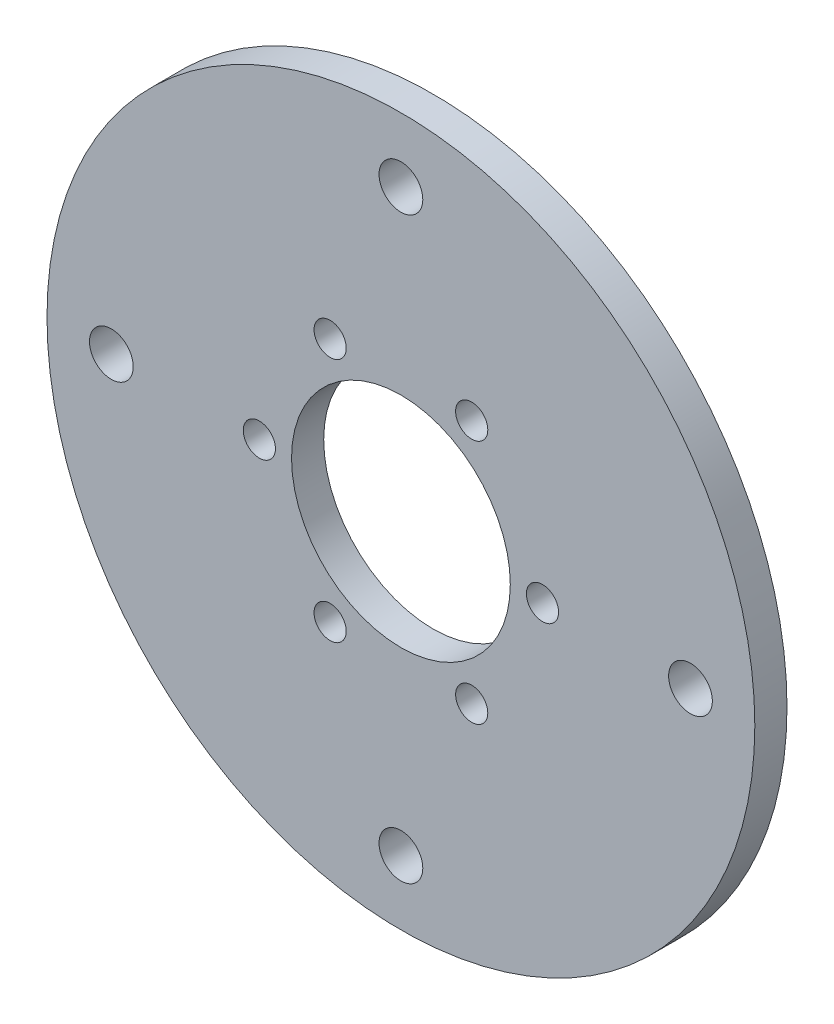
ISO-10303-21;
HEADER;
FILE_DESCRIPTION(('STEP AP214'),'2;1');
FILE_NAME('part.step','',(''),(''),'','','');
FILE_SCHEMA(('AUTOMOTIVE_DESIGN { 1 0 10303 214 1 1 1 1 }'));
ENDSEC;
DATA;
#1=APPLICATION_CONTEXT('core data for automotive mechanical design processes');
#2=APPLICATION_PROTOCOL_DEFINITION('international standard','automotive_design',2000,#1);
#3=PRODUCT_CONTEXT('',#1,'mechanical');
#4=PRODUCT('Part','Part','',(#3));
#5=PRODUCT_RELATED_PRODUCT_CATEGORY('part','',(#4));
#6=PRODUCT_DEFINITION_FORMATION('','',#4);
#7=PRODUCT_DEFINITION_CONTEXT('part definition',#1,'design');
#8=PRODUCT_DEFINITION('design','',#6,#7);
#9=PRODUCT_DEFINITION_SHAPE('','',#8);
#10=(LENGTH_UNIT() NAMED_UNIT(*) SI_UNIT(.MILLI.,.METRE.));
#11=(NAMED_UNIT(*) PLANE_ANGLE_UNIT() SI_UNIT($,.RADIAN.));
#12=(NAMED_UNIT(*) SI_UNIT($,.STERADIAN.) SOLID_ANGLE_UNIT());
#13=UNCERTAINTY_MEASURE_WITH_UNIT(LENGTH_MEASURE(1.E-05),#10,'distance_accuracy_value','');
#14=(GEOMETRIC_REPRESENTATION_CONTEXT(3) GLOBAL_UNCERTAINTY_ASSIGNED_CONTEXT((#13)) GLOBAL_UNIT_ASSIGNED_CONTEXT((#10,
#11,#12)) REPRESENTATION_CONTEXT('',''));
#15=CARTESIAN_POINT('',(0.,0.,0.));
#16=DIRECTION('',(0.,0.,1.));
#17=DIRECTION('',(1.,0.,0.));
#18=AXIS2_PLACEMENT_3D('',#15,#16,#17);
#19=CARTESIAN_POINT('',(0.,0.,5.));
#20=DIRECTION('',(0.,0.,1.));
#21=DIRECTION('',(1.,0.,0.));
#22=AXIS2_PLACEMENT_3D('',#19,#20,#21);
#23=PLANE('',#22);
#24=CARTESIAN_POINT('',(10.9999999999999,19.0525588832577,5.));
#25=DIRECTION('',(0.,0.,1.));
#26=DIRECTION('',(1.,0.,0.));
#27=AXIS2_PLACEMENT_3D('',#24,#25,#26);
#28=CIRCLE('',#27,2.5);
#29=CARTESIAN_POINT('',(13.4999999999999,19.0525588832577,5.));
#30=VERTEX_POINT('',#29);
#31=EDGE_CURVE('E105',#30,#30,#28,.T.);
#32=ORIENTED_EDGE('',*,*,#31,.F.);
#33=EDGE_LOOP('',(#32));
#34=FACE_BOUND('',#33,.T.);
#35=CARTESIAN_POINT('',(22.0000000000012,8.23535218910547E-13,5.));
#36=DIRECTION('',(0.,0.,1.));
#37=DIRECTION('',(1.,0.,0.));
#38=AXIS2_PLACEMENT_3D('',#35,#36,#37);
#39=CIRCLE('',#38,2.5);
#40=CARTESIAN_POINT('',(24.5000000000012,8.23535218910547E-13,5.));
#41=VERTEX_POINT('',#40);
#42=EDGE_CURVE('E99',#41,#41,#39,.T.);
#43=ORIENTED_EDGE('',*,*,#42,.F.);
#44=EDGE_LOOP('',(#43));
#45=FACE_BOUND('',#44,.T.);
#46=CARTESIAN_POINT('',(11.0000000000026,-19.0525588832576,5.));
#47=DIRECTION('',(0.,0.,1.));
#48=DIRECTION('',(1.,0.,0.));
#49=AXIS2_PLACEMENT_3D('',#46,#47,#48);
#50=CIRCLE('',#49,2.5);
#51=CARTESIAN_POINT('',(13.5000000000026,-19.0525588832576,5.));
#52=VERTEX_POINT('',#51);
#53=EDGE_CURVE('E93',#52,#52,#50,.T.);
#54=ORIENTED_EDGE('',*,*,#53,.F.);
#55=EDGE_LOOP('',(#54));
#56=FACE_BOUND('',#55,.T.);
#57=CARTESIAN_POINT('',(-10.9999999999975,-19.0525588832592,5.));
#58=DIRECTION('',(0.,0.,1.));
#59=DIRECTION('',(1.,0.,0.));
#60=AXIS2_PLACEMENT_3D('',#57,#58,#59);
#61=CIRCLE('',#60,2.5);
#62=CARTESIAN_POINT('',(-8.49999999999747,-19.0525588832592,5.));
#63=VERTEX_POINT('',#62);
#64=EDGE_CURVE('E87',#63,#63,#61,.T.);
#65=ORIENTED_EDGE('',*,*,#64,.F.);
#66=EDGE_LOOP('',(#65));
#67=FACE_BOUND('',#66,.T.);
#68=CARTESIAN_POINT('',(-21.9999999999988,-2.26747567222674E-12,5.));
#69=DIRECTION('',(0.,0.,1.));
#70=DIRECTION('',(1.,0.,0.));
#71=AXIS2_PLACEMENT_3D('',#68,#69,#70);
#72=CIRCLE('',#71,2.5);
#73=CARTESIAN_POINT('',(-19.4999999999988,-2.26747567222674E-12,5.));
#74=VERTEX_POINT('',#73);
#75=EDGE_CURVE('E81',#74,#74,#72,.T.);
#76=ORIENTED_EDGE('',*,*,#75,.F.);
#77=EDGE_LOOP('',(#76));
#78=FACE_BOUND('',#77,.T.);
#79=CARTESIAN_POINT('',(-11.0000000000001,19.0525588832562,5.));
#80=DIRECTION('',(0.,0.,1.));
#81=DIRECTION('',(1.,0.,0.));
#82=AXIS2_PLACEMENT_3D('',#79,#80,#81);
#83=CIRCLE('',#82,2.5);
#84=CARTESIAN_POINT('',(-8.50000000000013,19.0525588832562,5.));
#85=VERTEX_POINT('',#84);
#86=EDGE_CURVE('E75',#85,#85,#83,.T.);
#87=ORIENTED_EDGE('',*,*,#86,.F.);
#88=EDGE_LOOP('',(#87));
#89=FACE_BOUND('',#88,.T.);
#90=CARTESIAN_POINT('',(0.,45.,5.));
#91=DIRECTION('',(0.,0.,1.));
#92=DIRECTION('',(1.,0.,0.));
#93=AXIS2_PLACEMENT_3D('',#90,#91,#92);
#94=CIRCLE('',#93,3.4);
#95=CARTESIAN_POINT('',(3.4,45.,5.));
#96=VERTEX_POINT('',#95);
#97=EDGE_CURVE('E69',#96,#96,#94,.T.);
#98=ORIENTED_EDGE('',*,*,#97,.F.);
#99=EDGE_LOOP('',(#98));
#100=FACE_BOUND('',#99,.T.);
#101=CARTESIAN_POINT('',(45.0000000000013,1.30170402618255E-12,5.));
#102=DIRECTION('',(0.,0.,1.));
#103=DIRECTION('',(1.,0.,0.));
#104=AXIS2_PLACEMENT_3D('',#101,#102,#103);
#105=CIRCLE('',#104,3.4);
#106=CARTESIAN_POINT('',(48.4000000000013,1.30170402618255E-12,5.));
#107=VERTEX_POINT('',#106);
#108=EDGE_CURVE('E63',#107,#107,#105,.T.);
#109=ORIENTED_EDGE('',*,*,#108,.F.);
#110=EDGE_LOOP('',(#109));
#111=FACE_BOUND('',#110,.T.);
#112=CARTESIAN_POINT('',(2.6034080523651E-12,-45.,5.));
#113=DIRECTION('',(0.,0.,1.));
#114=DIRECTION('',(1.,0.,0.));
#115=AXIS2_PLACEMENT_3D('',#112,#113,#114);
#116=CIRCLE('',#115,3.4);
#117=CARTESIAN_POINT('',(3.4000000000026,-45.,5.));
#118=VERTEX_POINT('',#117);
#119=EDGE_CURVE('E57',#118,#118,#116,.T.);
#120=ORIENTED_EDGE('',*,*,#119,.F.);
#121=EDGE_LOOP('',(#120));
#122=FACE_BOUND('',#121,.T.);
#123=CARTESIAN_POINT('',(-44.9999999999987,-1.29619311558639E-12,5.));
#124=DIRECTION('',(0.,0.,1.));
#125=DIRECTION('',(1.,0.,0.));
#126=AXIS2_PLACEMENT_3D('',#123,#124,#125);
#127=CIRCLE('',#126,3.4);
#128=CARTESIAN_POINT('',(-41.5999999999987,-1.29619311558639E-12,5.));
#129=VERTEX_POINT('',#128);
#130=EDGE_CURVE('E51',#129,#129,#127,.T.);
#131=ORIENTED_EDGE('',*,*,#130,.F.);
#132=EDGE_LOOP('',(#131));
#133=FACE_BOUND('',#132,.T.);
#134=CARTESIAN_POINT('',(0.,0.,5.));
#135=DIRECTION('',(0.,0.,1.));
#136=DIRECTION('',(1.,0.,0.));
#137=AXIS2_PLACEMENT_3D('',#134,#135,#136);
#138=CIRCLE('',#137,55.);
#139=CARTESIAN_POINT('',(55.,0.,5.));
#140=VERTEX_POINT('',#139);
#141=EDGE_CURVE('E10',#140,#140,#138,.T.);
#142=ORIENTED_EDGE('',*,*,#141,.T.);
#143=EDGE_LOOP('',(#142));
#144=FACE_BOUND('',#143,.T.);
#145=CARTESIAN_POINT('',(0.,0.,5.));
#146=DIRECTION('',(0.,0.,1.));
#147=DIRECTION('',(1.,0.,0.));
#148=AXIS2_PLACEMENT_3D('',#145,#146,#147);
#149=CIRCLE('',#148,17.);
#150=CARTESIAN_POINT('',(17.,0.,5.));
#151=VERTEX_POINT('',#150);
#152=EDGE_CURVE('E41',#151,#151,#149,.T.);
#153=ORIENTED_EDGE('',*,*,#152,.F.);
#154=EDGE_LOOP('',(#153));
#155=FACE_BOUND('',#154,.T.);
#156=ADVANCED_FACE('F30',(#34,#45,#56,#67,#78,#89,#100,#111,#122,#133,#144,#155),#23,.T.);
#157=CARTESIAN_POINT('',(0.,0.,0.));
#158=DIRECTION('',(0.,0.,1.));
#159=DIRECTION('',(1.,0.,0.));
#160=AXIS2_PLACEMENT_3D('',#157,#158,#159);
#161=PLANE('',#160);
#162=CARTESIAN_POINT('',(10.9999999999999,19.0525588832577,0.));
#163=DIRECTION('',(0.,0.,1.));
#164=DIRECTION('',(1.,0.,0.));
#165=AXIS2_PLACEMENT_3D('',#162,#163,#164);
#166=CIRCLE('',#165,2.5);
#167=CARTESIAN_POINT('',(13.4999999999999,19.0525588832577,0.));
#168=VERTEX_POINT('',#167);
#169=EDGE_CURVE('E102',#168,#168,#166,.T.);
#170=ORIENTED_EDGE('',*,*,#169,.T.);
#171=EDGE_LOOP('',(#170));
#172=FACE_BOUND('',#171,.T.);
#173=CARTESIAN_POINT('',(22.0000000000012,8.23535218910547E-13,0.));
#174=DIRECTION('',(0.,0.,1.));
#175=DIRECTION('',(1.,0.,0.));
#176=AXIS2_PLACEMENT_3D('',#173,#174,#175);
#177=CIRCLE('',#176,2.5);
#178=CARTESIAN_POINT('',(24.5000000000012,8.23535218910547E-13,0.));
#179=VERTEX_POINT('',#178);
#180=EDGE_CURVE('E96',#179,#179,#177,.T.);
#181=ORIENTED_EDGE('',*,*,#180,.T.);
#182=EDGE_LOOP('',(#181));
#183=FACE_BOUND('',#182,.T.);
#184=CARTESIAN_POINT('',(11.0000000000026,-19.0525588832576,0.));
#185=DIRECTION('',(0.,0.,1.));
#186=DIRECTION('',(1.,0.,0.));
#187=AXIS2_PLACEMENT_3D('',#184,#185,#186);
#188=CIRCLE('',#187,2.5);
#189=CARTESIAN_POINT('',(13.5000000000026,-19.0525588832576,0.));
#190=VERTEX_POINT('',#189);
#191=EDGE_CURVE('E90',#190,#190,#188,.T.);
#192=ORIENTED_EDGE('',*,*,#191,.T.);
#193=EDGE_LOOP('',(#192));
#194=FACE_BOUND('',#193,.T.);
#195=CARTESIAN_POINT('',(-10.9999999999975,-19.0525588832592,0.));
#196=DIRECTION('',(0.,0.,1.));
#197=DIRECTION('',(1.,0.,0.));
#198=AXIS2_PLACEMENT_3D('',#195,#196,#197);
#199=CIRCLE('',#198,2.5);
#200=CARTESIAN_POINT('',(-8.49999999999747,-19.0525588832592,0.));
#201=VERTEX_POINT('',#200);
#202=EDGE_CURVE('E84',#201,#201,#199,.T.);
#203=ORIENTED_EDGE('',*,*,#202,.T.);
#204=EDGE_LOOP('',(#203));
#205=FACE_BOUND('',#204,.T.);
#206=CARTESIAN_POINT('',(-21.9999999999988,-2.26747567222674E-12,0.));
#207=DIRECTION('',(0.,0.,1.));
#208=DIRECTION('',(1.,0.,0.));
#209=AXIS2_PLACEMENT_3D('',#206,#207,#208);
#210=CIRCLE('',#209,2.5);
#211=CARTESIAN_POINT('',(-19.4999999999988,-2.26747567222674E-12,0.));
#212=VERTEX_POINT('',#211);
#213=EDGE_CURVE('E78',#212,#212,#210,.T.);
#214=ORIENTED_EDGE('',*,*,#213,.T.);
#215=EDGE_LOOP('',(#214));
#216=FACE_BOUND('',#215,.T.);
#217=CARTESIAN_POINT('',(-11.0000000000001,19.0525588832562,0.));
#218=DIRECTION('',(0.,0.,1.));
#219=DIRECTION('',(1.,0.,0.));
#220=AXIS2_PLACEMENT_3D('',#217,#218,#219);
#221=CIRCLE('',#220,2.5);
#222=CARTESIAN_POINT('',(-8.50000000000013,19.0525588832562,0.));
#223=VERTEX_POINT('',#222);
#224=EDGE_CURVE('E72',#223,#223,#221,.T.);
#225=ORIENTED_EDGE('',*,*,#224,.T.);
#226=EDGE_LOOP('',(#225));
#227=FACE_BOUND('',#226,.T.);
#228=CARTESIAN_POINT('',(0.,45.,0.));
#229=DIRECTION('',(0.,0.,1.));
#230=DIRECTION('',(1.,0.,0.));
#231=AXIS2_PLACEMENT_3D('',#228,#229,#230);
#232=CIRCLE('',#231,3.4);
#233=CARTESIAN_POINT('',(3.4,45.,0.));
#234=VERTEX_POINT('',#233);
#235=EDGE_CURVE('E66',#234,#234,#232,.T.);
#236=ORIENTED_EDGE('',*,*,#235,.T.);
#237=EDGE_LOOP('',(#236));
#238=FACE_BOUND('',#237,.T.);
#239=CARTESIAN_POINT('',(45.0000000000013,1.30170402618255E-12,0.));
#240=DIRECTION('',(0.,0.,1.));
#241=DIRECTION('',(1.,0.,0.));
#242=AXIS2_PLACEMENT_3D('',#239,#240,#241);
#243=CIRCLE('',#242,3.4);
#244=CARTESIAN_POINT('',(48.4000000000013,1.30170402618255E-12,0.));
#245=VERTEX_POINT('',#244);
#246=EDGE_CURVE('E60',#245,#245,#243,.T.);
#247=ORIENTED_EDGE('',*,*,#246,.T.);
#248=EDGE_LOOP('',(#247));
#249=FACE_BOUND('',#248,.T.);
#250=CARTESIAN_POINT('',(2.6034080523651E-12,-45.,0.));
#251=DIRECTION('',(0.,0.,1.));
#252=DIRECTION('',(1.,0.,0.));
#253=AXIS2_PLACEMENT_3D('',#250,#251,#252);
#254=CIRCLE('',#253,3.4);
#255=CARTESIAN_POINT('',(3.4000000000026,-45.,0.));
#256=VERTEX_POINT('',#255);
#257=EDGE_CURVE('E54',#256,#256,#254,.T.);
#258=ORIENTED_EDGE('',*,*,#257,.T.);
#259=EDGE_LOOP('',(#258));
#260=FACE_BOUND('',#259,.T.);
#261=CARTESIAN_POINT('',(-44.9999999999987,-1.29619311558639E-12,0.));
#262=DIRECTION('',(0.,0.,1.));
#263=DIRECTION('',(1.,0.,0.));
#264=AXIS2_PLACEMENT_3D('',#261,#262,#263);
#265=CIRCLE('',#264,3.4);
#266=CARTESIAN_POINT('',(-41.5999999999987,-1.29619311558639E-12,0.));
#267=VERTEX_POINT('',#266);
#268=EDGE_CURVE('E46',#267,#267,#265,.T.);
#269=ORIENTED_EDGE('',*,*,#268,.T.);
#270=EDGE_LOOP('',(#269));
#271=FACE_BOUND('',#270,.T.);
#272=CARTESIAN_POINT('',(0.,0.,0.));
#273=DIRECTION('',(0.,0.,1.));
#274=DIRECTION('',(1.,0.,0.));
#275=AXIS2_PLACEMENT_3D('',#272,#273,#274);
#276=CIRCLE('',#275,55.);
#277=CARTESIAN_POINT('',(55.,0.,0.));
#278=VERTEX_POINT('',#277);
#279=EDGE_CURVE('E34',#278,#278,#276,.T.);
#280=ORIENTED_EDGE('',*,*,#279,.F.);
#281=EDGE_LOOP('',(#280));
#282=FACE_BOUND('',#281,.T.);
#283=CARTESIAN_POINT('',(0.,0.,0.));
#284=DIRECTION('',(0.,0.,1.));
#285=DIRECTION('',(1.,0.,0.));
#286=AXIS2_PLACEMENT_3D('',#283,#284,#285);
#287=CIRCLE('',#286,17.);
#288=CARTESIAN_POINT('',(17.,0.,0.));
#289=VERTEX_POINT('',#288);
#290=EDGE_CURVE('E43',#289,#289,#287,.T.);
#291=ORIENTED_EDGE('',*,*,#290,.T.);
#292=EDGE_LOOP('',(#291));
#293=FACE_BOUND('',#292,.T.);
#294=ADVANCED_FACE('F113',(#172,#183,#194,#205,#216,#227,#238,#249,#260,#271,#282,#293),#161,.F.);
#295=CARTESIAN_POINT('',(0.,0.,5.));
#296=DIRECTION('',(0.,0.,-1.));
#297=DIRECTION('',(-1.,0.,0.));
#298=AXIS2_PLACEMENT_3D('',#295,#296,#297);
#299=CYLINDRICAL_SURFACE('',#298,55.);
#300=ORIENTED_EDGE('',*,*,#141,.F.);
#301=EDGE_LOOP('',(#300));
#302=FACE_BOUND('',#301,.T.);
#303=ORIENTED_EDGE('',*,*,#279,.T.);
#304=EDGE_LOOP('',(#303));
#305=FACE_BOUND('',#304,.T.);
#306=ADVANCED_FACE('F32',(#302,#305),#299,.T.);
#307=CARTESIAN_POINT('',(0.,0.,5.));
#308=DIRECTION('',(0.,0.,-1.));
#309=DIRECTION('',(-1.,0.,0.));
#310=AXIS2_PLACEMENT_3D('',#307,#308,#309);
#311=CYLINDRICAL_SURFACE('',#310,17.);
#312=ORIENTED_EDGE('',*,*,#152,.T.);
#313=EDGE_LOOP('',(#312));
#314=FACE_BOUND('',#313,.T.);
#315=ORIENTED_EDGE('',*,*,#290,.F.);
#316=EDGE_LOOP('',(#315));
#317=FACE_BOUND('',#316,.T.);
#318=ADVANCED_FACE('F135',(#314,#317),#311,.F.);
#319=CARTESIAN_POINT('',(-44.9999999999987,-1.29619311558639E-12,5.));
#320=DIRECTION('',(0.,0.,1.));
#321=DIRECTION('',(1.,0.,0.));
#322=AXIS2_PLACEMENT_3D('',#319,#320,#321);
#323=CYLINDRICAL_SURFACE('',#322,3.4);
#324=ORIENTED_EDGE('',*,*,#268,.F.);
#325=EDGE_LOOP('',(#324));
#326=FACE_BOUND('',#325,.T.);
#327=ORIENTED_EDGE('',*,*,#130,.T.);
#328=EDGE_LOOP('',(#327));
#329=FACE_BOUND('',#328,.T.);
#330=ADVANCED_FACE('F138',(#326,#329),#323,.F.);
#331=CARTESIAN_POINT('',(2.6034080523651E-12,-45.,5.));
#332=DIRECTION('',(0.,0.,1.));
#333=DIRECTION('',(1.,0.,0.));
#334=AXIS2_PLACEMENT_3D('',#331,#332,#333);
#335=CYLINDRICAL_SURFACE('',#334,3.4);
#336=ORIENTED_EDGE('',*,*,#257,.F.);
#337=EDGE_LOOP('',(#336));
#338=FACE_BOUND('',#337,.T.);
#339=ORIENTED_EDGE('',*,*,#119,.T.);
#340=EDGE_LOOP('',(#339));
#341=FACE_BOUND('',#340,.T.);
#342=ADVANCED_FACE('F152',(#338,#341),#335,.F.);
#343=CARTESIAN_POINT('',(45.0000000000013,1.30170402618255E-12,5.));
#344=DIRECTION('',(0.,0.,1.));
#345=DIRECTION('',(1.,0.,0.));
#346=AXIS2_PLACEMENT_3D('',#343,#344,#345);
#347=CYLINDRICAL_SURFACE('',#346,3.4);
#348=ORIENTED_EDGE('',*,*,#246,.F.);
#349=EDGE_LOOP('',(#348));
#350=FACE_BOUND('',#349,.T.);
#351=ORIENTED_EDGE('',*,*,#108,.T.);
#352=EDGE_LOOP('',(#351));
#353=FACE_BOUND('',#352,.T.);
#354=ADVANCED_FACE('F156',(#350,#353),#347,.F.);
#355=CARTESIAN_POINT('',(0.,45.,5.));
#356=DIRECTION('',(0.,0.,1.));
#357=DIRECTION('',(1.,0.,0.));
#358=AXIS2_PLACEMENT_3D('',#355,#356,#357);
#359=CYLINDRICAL_SURFACE('',#358,3.4);
#360=ORIENTED_EDGE('',*,*,#235,.F.);
#361=EDGE_LOOP('',(#360));
#362=FACE_BOUND('',#361,.T.);
#363=ORIENTED_EDGE('',*,*,#97,.T.);
#364=EDGE_LOOP('',(#363));
#365=FACE_BOUND('',#364,.T.);
#366=ADVANCED_FACE('F160',(#362,#365),#359,.F.);
#367=CARTESIAN_POINT('',(-11.0000000000001,19.0525588832562,5.));
#368=DIRECTION('',(0.,0.,1.));
#369=DIRECTION('',(1.,0.,0.));
#370=AXIS2_PLACEMENT_3D('',#367,#368,#369);
#371=CYLINDRICAL_SURFACE('',#370,2.5);
#372=ORIENTED_EDGE('',*,*,#224,.F.);
#373=EDGE_LOOP('',(#372));
#374=FACE_BOUND('',#373,.T.);
#375=ORIENTED_EDGE('',*,*,#86,.T.);
#376=EDGE_LOOP('',(#375));
#377=FACE_BOUND('',#376,.T.);
#378=ADVANCED_FACE('F164',(#374,#377),#371,.F.);
#379=CARTESIAN_POINT('',(-21.9999999999988,-2.26747567222674E-12,5.));
#380=DIRECTION('',(0.,0.,1.));
#381=DIRECTION('',(1.,0.,0.));
#382=AXIS2_PLACEMENT_3D('',#379,#380,#381);
#383=CYLINDRICAL_SURFACE('',#382,2.5);
#384=ORIENTED_EDGE('',*,*,#213,.F.);
#385=EDGE_LOOP('',(#384));
#386=FACE_BOUND('',#385,.T.);
#387=ORIENTED_EDGE('',*,*,#75,.T.);
#388=EDGE_LOOP('',(#387));
#389=FACE_BOUND('',#388,.T.);
#390=ADVANCED_FACE('F168',(#386,#389),#383,.F.);
#391=CARTESIAN_POINT('',(-10.9999999999975,-19.0525588832592,5.));
#392=DIRECTION('',(0.,0.,1.));
#393=DIRECTION('',(1.,0.,0.));
#394=AXIS2_PLACEMENT_3D('',#391,#392,#393);
#395=CYLINDRICAL_SURFACE('',#394,2.5);
#396=ORIENTED_EDGE('',*,*,#202,.F.);
#397=EDGE_LOOP('',(#396));
#398=FACE_BOUND('',#397,.T.);
#399=ORIENTED_EDGE('',*,*,#64,.T.);
#400=EDGE_LOOP('',(#399));
#401=FACE_BOUND('',#400,.T.);
#402=ADVANCED_FACE('F172',(#398,#401),#395,.F.);
#403=CARTESIAN_POINT('',(11.0000000000026,-19.0525588832576,5.));
#404=DIRECTION('',(0.,0.,1.));
#405=DIRECTION('',(1.,0.,0.));
#406=AXIS2_PLACEMENT_3D('',#403,#404,#405);
#407=CYLINDRICAL_SURFACE('',#406,2.5);
#408=ORIENTED_EDGE('',*,*,#191,.F.);
#409=EDGE_LOOP('',(#408));
#410=FACE_BOUND('',#409,.T.);
#411=ORIENTED_EDGE('',*,*,#53,.T.);
#412=EDGE_LOOP('',(#411));
#413=FACE_BOUND('',#412,.T.);
#414=ADVANCED_FACE('F176',(#410,#413),#407,.F.);
#415=CARTESIAN_POINT('',(22.0000000000012,8.23535218910547E-13,5.));
#416=DIRECTION('',(0.,0.,1.));
#417=DIRECTION('',(1.,0.,0.));
#418=AXIS2_PLACEMENT_3D('',#415,#416,#417);
#419=CYLINDRICAL_SURFACE('',#418,2.5);
#420=ORIENTED_EDGE('',*,*,#180,.F.);
#421=EDGE_LOOP('',(#420));
#422=FACE_BOUND('',#421,.T.);
#423=ORIENTED_EDGE('',*,*,#42,.T.);
#424=EDGE_LOOP('',(#423));
#425=FACE_BOUND('',#424,.T.);
#426=ADVANCED_FACE('F180',(#422,#425),#419,.F.);
#427=CARTESIAN_POINT('',(10.9999999999999,19.0525588832577,5.));
#428=DIRECTION('',(0.,0.,1.));
#429=DIRECTION('',(1.,0.,0.));
#430=AXIS2_PLACEMENT_3D('',#427,#428,#429);
#431=CYLINDRICAL_SURFACE('',#430,2.5);
#432=ORIENTED_EDGE('',*,*,#169,.F.);
#433=EDGE_LOOP('',(#432));
#434=FACE_BOUND('',#433,.T.);
#435=ORIENTED_EDGE('',*,*,#31,.T.);
#436=EDGE_LOOP('',(#435));
#437=FACE_BOUND('',#436,.T.);
#438=ADVANCED_FACE('F109',(#434,#437),#431,.F.);
#439=CLOSED_SHELL('',(#156,#294,#306,#318,#330,#342,#354,#366,#378,#390,#402,#414,#426,#438));
#440=MANIFOLD_SOLID_BREP('B2',#439);
#441=ADVANCED_BREP_SHAPE_REPRESENTATION('',(#18,#440),#14);
#442=SHAPE_DEFINITION_REPRESENTATION(#9,#441);
ENDSEC;
END-ISO-10303-21;
